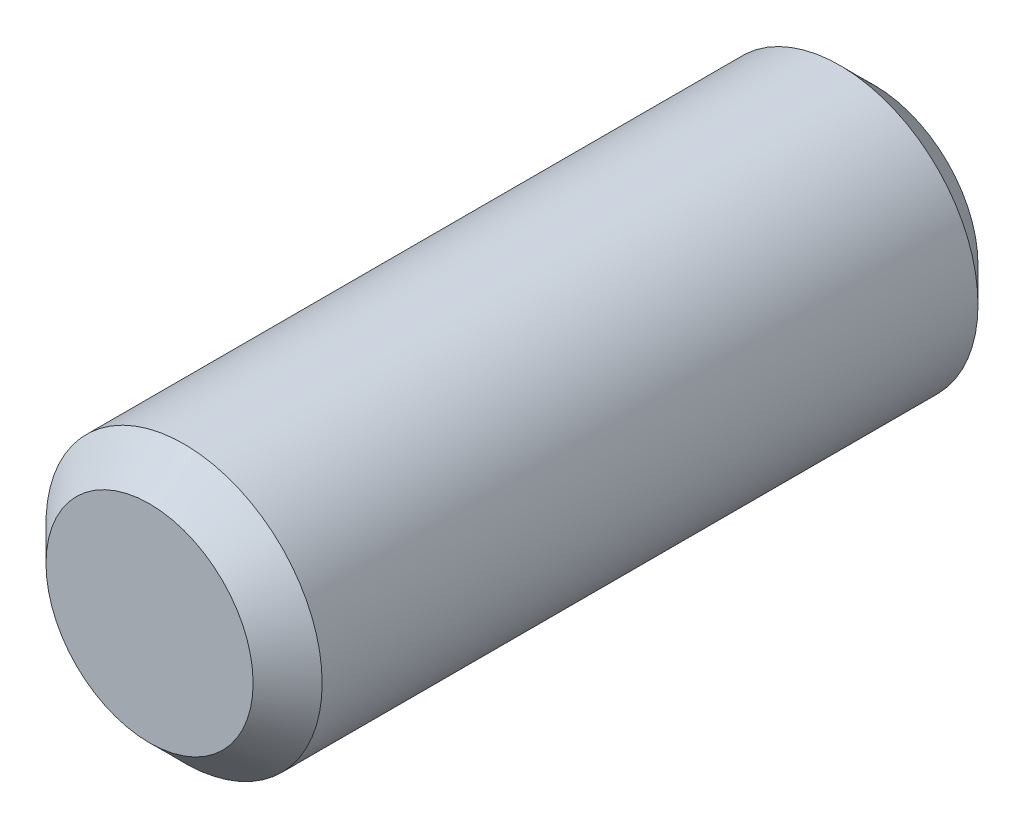
ISO-10303-21;
HEADER;
FILE_DESCRIPTION(('STEP AP214'),'2;1');
FILE_NAME('part.step','',(''),(''),'','','');
FILE_SCHEMA(('AUTOMOTIVE_DESIGN { 1 0 10303 214 1 1 1 1 }'));
ENDSEC;
DATA;
#1=APPLICATION_CONTEXT('core data for automotive mechanical design processes');
#2=APPLICATION_PROTOCOL_DEFINITION('international standard','automotive_design',2000,#1);
#3=PRODUCT_CONTEXT('',#1,'mechanical');
#4=PRODUCT('Part','Part','',(#3));
#5=PRODUCT_RELATED_PRODUCT_CATEGORY('part','',(#4));
#6=PRODUCT_DEFINITION_FORMATION('','',#4);
#7=PRODUCT_DEFINITION_CONTEXT('part definition',#1,'design');
#8=PRODUCT_DEFINITION('design','',#6,#7);
#9=PRODUCT_DEFINITION_SHAPE('','',#8);
#10=(LENGTH_UNIT() NAMED_UNIT(*) SI_UNIT(.MILLI.,.METRE.));
#11=(NAMED_UNIT(*) PLANE_ANGLE_UNIT() SI_UNIT($,.RADIAN.));
#12=(NAMED_UNIT(*) SI_UNIT($,.STERADIAN.) SOLID_ANGLE_UNIT());
#13=UNCERTAINTY_MEASURE_WITH_UNIT(LENGTH_MEASURE(1.E-05),#10,'distance_accuracy_value','');
#14=(GEOMETRIC_REPRESENTATION_CONTEXT(3) GLOBAL_UNCERTAINTY_ASSIGNED_CONTEXT((#13)) GLOBAL_UNIT_ASSIGNED_CONTEXT((#10,
#11,#12)) REPRESENTATION_CONTEXT('',''));
#15=CARTESIAN_POINT('',(0.,0.,0.));
#16=DIRECTION('',(0.,0.,1.));
#17=DIRECTION('',(1.,0.,0.));
#18=AXIS2_PLACEMENT_3D('',#15,#16,#17);
#19=CARTESIAN_POINT('',(0.,0.,21.));
#20=DIRECTION('',(0.,0.,-1.));
#21=DIRECTION('',(-1.,0.,0.));
#22=AXIS2_PLACEMENT_3D('',#19,#20,#21);
#23=CYLINDRICAL_SURFACE('',#22,4.);
#24=CARTESIAN_POINT('',(0.,0.,1.00000000000002));
#25=DIRECTION('',(0.,0.,1.));
#26=DIRECTION('',(1.,0.,0.));
#27=AXIS2_PLACEMENT_3D('',#24,#25,#26);
#28=CIRCLE('',#27,4.);
#29=CARTESIAN_POINT('',(4.,0.,1.00000000000002));
#30=VERTEX_POINT('',#29);
#31=EDGE_CURVE('E42',#30,#30,#28,.T.);
#32=ORIENTED_EDGE('',*,*,#31,.T.);
#33=EDGE_LOOP('',(#32));
#34=FACE_BOUND('',#33,.T.);
#35=CARTESIAN_POINT('',(0.,0.,20.));
#36=DIRECTION('',(0.,0.,1.));
#37=DIRECTION('',(1.,0.,0.));
#38=AXIS2_PLACEMENT_3D('',#35,#36,#37);
#39=CIRCLE('',#38,4.);
#40=CARTESIAN_POINT('',(4.,0.,20.));
#41=VERTEX_POINT('',#40);
#42=EDGE_CURVE('E46',#41,#41,#39,.F.);
#43=ORIENTED_EDGE('',*,*,#42,.T.);
#44=EDGE_LOOP('',(#43));
#45=FACE_BOUND('',#44,.T.);
#46=ADVANCED_FACE('F31',(#34,#45),#23,.T.);
#47=CARTESIAN_POINT('',(0.,0.,21.));
#48=DIRECTION('',(0.,0.,1.));
#49=DIRECTION('',(1.,0.,0.));
#50=AXIS2_PLACEMENT_3D('',#47,#48,#49);
#51=PLANE('',#50);
#52=CARTESIAN_POINT('',(0.,0.,21.));
#53=DIRECTION('',(0.,0.,1.));
#54=DIRECTION('',(1.,0.,0.));
#55=AXIS2_PLACEMENT_3D('',#52,#53,#54);
#56=CIRCLE('',#55,3.00000000000001);
#57=CARTESIAN_POINT('',(3.00000000000001,0.,21.));
#58=VERTEX_POINT('',#57);
#59=EDGE_CURVE('E10',#58,#58,#56,.T.);
#60=ORIENTED_EDGE('',*,*,#59,.T.);
#61=EDGE_LOOP('',(#60));
#62=FACE_BOUND('',#61,.T.);
#63=ADVANCED_FACE('F62',(#62),#51,.T.);
#64=CARTESIAN_POINT('',(0.,0.,0.));
#65=DIRECTION('',(0.,0.,1.));
#66=DIRECTION('',(1.,0.,0.));
#67=AXIS2_PLACEMENT_3D('',#64,#65,#66);
#68=PLANE('',#67);
#69=CARTESIAN_POINT('',(0.,0.,0.));
#70=DIRECTION('',(0.,0.,1.));
#71=DIRECTION('',(1.,0.,0.));
#72=AXIS2_PLACEMENT_3D('',#69,#70,#71);
#73=CIRCLE('',#72,2.99999999999998);
#74=CARTESIAN_POINT('',(2.99999999999998,0.,0.));
#75=VERTEX_POINT('',#74);
#76=EDGE_CURVE('E38',#75,#75,#73,.F.);
#77=ORIENTED_EDGE('',*,*,#76,.T.);
#78=EDGE_LOOP('',(#77));
#79=FACE_BOUND('',#78,.T.);
#80=ADVANCED_FACE('F59',(#79),#68,.F.);
#81=CARTESIAN_POINT('',(0.,0.,1.00000000000002));
#82=DIRECTION('',(0.,0.,1.));
#83=DIRECTION('',(1.,0.,0.));
#84=AXIS2_PLACEMENT_3D('',#81,#82,#83);
#85=CONICAL_SURFACE('',#84,4.,0.78539816339745);
#86=ORIENTED_EDGE('',*,*,#76,.F.);
#87=EDGE_LOOP('',(#86));
#88=FACE_BOUND('',#87,.T.);
#89=ORIENTED_EDGE('',*,*,#31,.F.);
#90=EDGE_LOOP('',(#89));
#91=FACE_BOUND('',#90,.T.);
#92=ADVANCED_FACE('F55',(#88,#91),#85,.T.);
#93=CARTESIAN_POINT('',(0.,0.,21.));
#94=DIRECTION('',(0.,0.,-1.));
#95=DIRECTION('',(-1.,0.,0.));
#96=AXIS2_PLACEMENT_3D('',#93,#94,#95);
#97=CONICAL_SURFACE('',#96,3.00000000000001,0.785398163397449);
#98=ORIENTED_EDGE('',*,*,#42,.F.);
#99=EDGE_LOOP('',(#98));
#100=FACE_BOUND('',#99,.T.);
#101=ORIENTED_EDGE('',*,*,#59,.F.);
#102=EDGE_LOOP('',(#101));
#103=FACE_BOUND('',#102,.T.);
#104=ADVANCED_FACE('F33',(#100,#103),#97,.T.);
#105=CLOSED_SHELL('',(#46,#63,#80,#92,#104));
#106=MANIFOLD_SOLID_BREP('B2',#105);
#107=ADVANCED_BREP_SHAPE_REPRESENTATION('',(#18,#106),#14);
#108=SHAPE_DEFINITION_REPRESENTATION(#9,#107);
ENDSEC;
END-ISO-10303-21;
